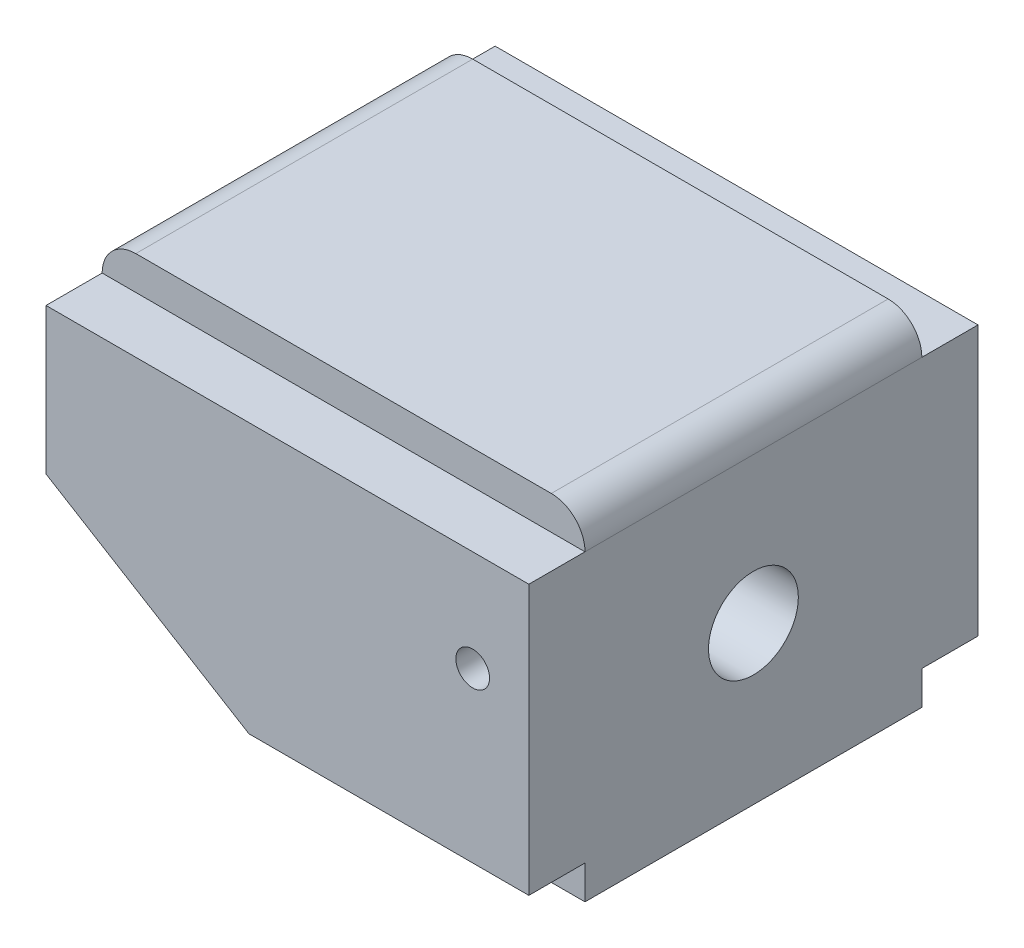
ISO-10303-21;
HEADER;
FILE_DESCRIPTION(('STEP AP214'),'2;1');
FILE_NAME('part.step','',(''),(''),'','','');
FILE_SCHEMA(('AUTOMOTIVE_DESIGN { 1 0 10303 214 1 1 1 1 }'));
ENDSEC;
DATA;
#1=APPLICATION_CONTEXT('core data for automotive mechanical design processes');
#2=APPLICATION_PROTOCOL_DEFINITION('international standard','automotive_design',2000,#1);
#3=PRODUCT_CONTEXT('',#1,'mechanical');
#4=PRODUCT('Part','Part','',(#3));
#5=PRODUCT_RELATED_PRODUCT_CATEGORY('part','',(#4));
#6=PRODUCT_DEFINITION_FORMATION('','',#4);
#7=PRODUCT_DEFINITION_CONTEXT('part definition',#1,'design');
#8=PRODUCT_DEFINITION('design','',#6,#7);
#9=PRODUCT_DEFINITION_SHAPE('','',#8);
#10=(LENGTH_UNIT() NAMED_UNIT(*) SI_UNIT(.MILLI.,.METRE.));
#11=(NAMED_UNIT(*) PLANE_ANGLE_UNIT() SI_UNIT($,.RADIAN.));
#12=(NAMED_UNIT(*) SI_UNIT($,.STERADIAN.) SOLID_ANGLE_UNIT());
#13=UNCERTAINTY_MEASURE_WITH_UNIT(LENGTH_MEASURE(1.E-05),#10,'distance_accuracy_value','');
#14=(GEOMETRIC_REPRESENTATION_CONTEXT(3) GLOBAL_UNCERTAINTY_ASSIGNED_CONTEXT((#13)) GLOBAL_UNIT_ASSIGNED_CONTEXT((#10,
#11,#12)) REPRESENTATION_CONTEXT('',''));
#15=CARTESIAN_POINT('',(0.,0.,0.));
#16=DIRECTION('',(0.,0.,1.));
#17=DIRECTION('',(1.,0.,0.));
#18=AXIS2_PLACEMENT_3D('',#15,#16,#17);
#19=CARTESIAN_POINT('',(0.,0.,-20.));
#20=DIRECTION('',(0.,0.,-1.));
#21=DIRECTION('',(-1.,0.,0.));
#22=AXIS2_PLACEMENT_3D('',#19,#20,#21);
#23=PLANE('',#22);
#24=DIRECTION('',(0.,-1.,0.));
#25=VECTOR('',#24,1.);
#26=CARTESIAN_POINT('',(-43.,14.,-20.));
#27=LINE('',#26,#25);
#28=CARTESIAN_POINT('',(-43.,27.,-20.));
#29=VERTEX_POINT('',#28);
#30=CARTESIAN_POINT('',(-43.,14.,-20.));
#31=VERTEX_POINT('',#30);
#32=EDGE_CURVE('E188',#29,#31,#27,.T.);
#33=ORIENTED_EDGE('',*,*,#32,.F.);
#34=DIRECTION('',(-1.,0.,0.));
#35=VECTOR('',#34,1.);
#36=CARTESIAN_POINT('',(-43.,27.,-20.));
#37=LINE('',#36,#35);
#38=CARTESIAN_POINT('',(0.,27.,-20.));
#39=VERTEX_POINT('',#38);
#40=EDGE_CURVE('E203',#39,#29,#37,.T.);
#41=ORIENTED_EDGE('',*,*,#40,.F.);
#42=DIRECTION('',(0.,1.,0.));
#43=VECTOR('',#42,1.);
#44=CARTESIAN_POINT('',(0.,27.,-20.));
#45=LINE('',#44,#43);
#46=CARTESIAN_POINT('',(0.,3.,-20.));
#47=VERTEX_POINT('',#46);
#48=EDGE_CURVE('E199',#47,#39,#45,.T.);
#49=ORIENTED_EDGE('',*,*,#48,.F.);
#50=DIRECTION('',(1.,0.,0.));
#51=VECTOR('',#50,1.);
#52=CARTESIAN_POINT('',(0.,3.,-20.));
#53=LINE('',#52,#51);
#54=CARTESIAN_POINT('',(-24.9285714285714,3.,-20.));
#55=VERTEX_POINT('',#54);
#56=EDGE_CURVE('E195',#55,#47,#53,.T.);
#57=ORIENTED_EDGE('',*,*,#56,.F.);
#58=DIRECTION('',(0.854198555614439,-0.519946946895745,0.));
#59=VECTOR('',#58,1.);
#60=CARTESIAN_POINT('',(-24.9285714285714,3.,-20.));
#61=LINE('',#60,#59);
#62=EDGE_CURVE('E192',#31,#55,#61,.T.);
#63=ORIENTED_EDGE('',*,*,#62,.F.);
#64=EDGE_LOOP('',(#33,#41,#49,#57,#63));
#65=FACE_BOUND('',#64,.T.);
#66=CARTESIAN_POINT('',(-5.,18.,-20.));
#67=DIRECTION('',(0.,0.,1.));
#68=DIRECTION('',(1.,0.,0.));
#69=AXIS2_PLACEMENT_3D('',#66,#67,#68);
#70=CIRCLE('',#69,1.49999999999999);
#71=CARTESIAN_POINT('',(-3.5,18.,-20.));
#72=VERTEX_POINT('',#71);
#73=EDGE_CURVE('E164',#72,#72,#70,.T.);
#74=ORIENTED_EDGE('',*,*,#73,.T.);
#75=EDGE_LOOP('',(#74));
#76=FACE_BOUND('',#75,.T.);
#77=ADVANCED_FACE('F39',(#65,#76),#23,.T.);
#78=CARTESIAN_POINT('',(0.,0.,20.));
#79=DIRECTION('',(0.,0.,-1.));
#80=DIRECTION('',(-1.,0.,0.));
#81=AXIS2_PLACEMENT_3D('',#78,#79,#80);
#82=PLANE('',#81);
#83=DIRECTION('',(0.,-1.,0.));
#84=VECTOR('',#83,1.);
#85=CARTESIAN_POINT('',(-43.,14.,20.));
#86=LINE('',#85,#84);
#87=CARTESIAN_POINT('',(-43.,27.,20.));
#88=VERTEX_POINT('',#87);
#89=CARTESIAN_POINT('',(-43.,14.,20.));
#90=VERTEX_POINT('',#89);
#91=EDGE_CURVE('E168',#88,#90,#86,.T.);
#92=ORIENTED_EDGE('',*,*,#91,.T.);
#93=DIRECTION('',(0.854198555614439,-0.519946946895745,0.));
#94=VECTOR('',#93,1.);
#95=CARTESIAN_POINT('',(-24.9285714285714,3.,20.));
#96=LINE('',#95,#94);
#97=CARTESIAN_POINT('',(-24.9285714285714,3.,20.));
#98=VERTEX_POINT('',#97);
#99=EDGE_CURVE('E172',#90,#98,#96,.T.);
#100=ORIENTED_EDGE('',*,*,#99,.T.);
#101=DIRECTION('',(1.,0.,0.));
#102=VECTOR('',#101,1.);
#103=CARTESIAN_POINT('',(0.,3.,20.));
#104=LINE('',#103,#102);
#105=CARTESIAN_POINT('',(0.,3.,20.));
#106=VERTEX_POINT('',#105);
#107=EDGE_CURVE('E176',#98,#106,#104,.T.);
#108=ORIENTED_EDGE('',*,*,#107,.T.);
#109=DIRECTION('',(0.,1.,0.));
#110=VECTOR('',#109,1.);
#111=CARTESIAN_POINT('',(0.,27.,20.));
#112=LINE('',#111,#110);
#113=CARTESIAN_POINT('',(0.,27.,20.));
#114=VERTEX_POINT('',#113);
#115=EDGE_CURVE('E180',#106,#114,#112,.T.);
#116=ORIENTED_EDGE('',*,*,#115,.T.);
#117=DIRECTION('',(-1.,0.,0.));
#118=VECTOR('',#117,1.);
#119=CARTESIAN_POINT('',(-43.,27.,20.));
#120=LINE('',#119,#118);
#121=EDGE_CURVE('E184',#114,#88,#120,.T.);
#122=ORIENTED_EDGE('',*,*,#121,.T.);
#123=EDGE_LOOP('',(#92,#100,#108,#116,#122));
#124=FACE_BOUND('',#123,.T.);
#125=CARTESIAN_POINT('',(-5.,18.,20.));
#126=DIRECTION('',(0.,0.,1.));
#127=DIRECTION('',(1.,0.,0.));
#128=AXIS2_PLACEMENT_3D('',#125,#126,#127);
#129=CIRCLE('',#128,1.5);
#130=CARTESIAN_POINT('',(-3.5,18.,20.));
#131=VERTEX_POINT('',#130);
#132=EDGE_CURVE('E157',#131,#131,#129,.T.);
#133=ORIENTED_EDGE('',*,*,#132,.F.);
#134=EDGE_LOOP('',(#133));
#135=FACE_BOUND('',#134,.T.);
#136=ADVANCED_FACE('F321',(#124,#135),#82,.F.);
#137=CARTESIAN_POINT('',(0.,0.,15.));
#138=DIRECTION('',(0.,0.,-1.));
#139=DIRECTION('',(-1.,0.,0.));
#140=AXIS2_PLACEMENT_3D('',#137,#138,#139);
#141=PLANE('',#140);
#142=CARTESIAN_POINT('',(-40.,27.,15.));
#143=DIRECTION('',(0.,0.,-1.));
#144=DIRECTION('',(-1.,0.,0.));
#145=AXIS2_PLACEMENT_3D('',#142,#143,#144);
#146=CIRCLE('',#145,3.);
#147=CARTESIAN_POINT('',(-40.,30.,15.));
#148=VERTEX_POINT('',#147);
#149=CARTESIAN_POINT('',(-43.,27.,15.));
#150=VERTEX_POINT('',#149);
#151=EDGE_CURVE('E290',#148,#150,#146,.F.);
#152=ORIENTED_EDGE('',*,*,#151,.T.);
#153=DIRECTION('',(1.,0.,0.));
#154=VECTOR('',#153,1.);
#155=CARTESIAN_POINT('',(0.,27.,15.));
#156=LINE('',#155,#154);
#157=CARTESIAN_POINT('',(0.,27.,15.));
#158=VERTEX_POINT('',#157);
#159=EDGE_CURVE('E226',#150,#158,#156,.T.);
#160=ORIENTED_EDGE('',*,*,#159,.T.);
#161=CARTESIAN_POINT('',(-3.,27.,15.));
#162=DIRECTION('',(0.,0.,-1.));
#163=DIRECTION('',(-1.,0.,0.));
#164=AXIS2_PLACEMENT_3D('',#161,#162,#163);
#165=CIRCLE('',#164,3.);
#166=CARTESIAN_POINT('',(-3.,30.,15.));
#167=VERTEX_POINT('',#166);
#168=EDGE_CURVE('E287',#158,#167,#165,.F.);
#169=ORIENTED_EDGE('',*,*,#168,.T.);
#170=DIRECTION('',(-1.,0.,0.));
#171=VECTOR('',#170,1.);
#172=CARTESIAN_POINT('',(-43.,30.,15.));
#173=LINE('',#172,#171);
#174=EDGE_CURVE('E235',#167,#148,#173,.T.);
#175=ORIENTED_EDGE('',*,*,#174,.T.);
#176=EDGE_LOOP('',(#152,#160,#169,#175));
#177=FACE_BOUND('',#176,.T.);
#178=ADVANCED_FACE('F350',(#177),#141,.F.);
#179=CARTESIAN_POINT('',(0.,0.,-15.));
#180=DIRECTION('',(0.,0.,-1.));
#181=DIRECTION('',(-1.,0.,0.));
#182=AXIS2_PLACEMENT_3D('',#179,#180,#181);
#183=PLANE('',#182);
#184=DIRECTION('',(1.,0.,0.));
#185=VECTOR('',#184,1.);
#186=CARTESIAN_POINT('',(0.,27.,-15.));
#187=LINE('',#186,#185);
#188=CARTESIAN_POINT('',(-43.,27.,-15.));
#189=VERTEX_POINT('',#188);
#190=CARTESIAN_POINT('',(0.,27.,-15.));
#191=VERTEX_POINT('',#190);
#192=EDGE_CURVE('E211',#189,#191,#187,.T.);
#193=ORIENTED_EDGE('',*,*,#192,.F.);
#194=CARTESIAN_POINT('',(-40.,27.,-15.));
#195=DIRECTION('',(0.,0.,-1.));
#196=DIRECTION('',(-1.,0.,0.));
#197=AXIS2_PLACEMENT_3D('',#194,#195,#196);
#198=CIRCLE('',#197,3.);
#199=CARTESIAN_POINT('',(-40.,30.,-15.));
#200=VERTEX_POINT('',#199);
#201=EDGE_CURVE('E277',#189,#200,#198,.T.);
#202=ORIENTED_EDGE('',*,*,#201,.T.);
#203=DIRECTION('',(-1.,0.,0.));
#204=VECTOR('',#203,1.);
#205=CARTESIAN_POINT('',(-43.,30.,-15.));
#206=LINE('',#205,#204);
#207=CARTESIAN_POINT('',(-3.,30.,-15.));
#208=VERTEX_POINT('',#207);
#209=EDGE_CURVE('E250',#208,#200,#206,.T.);
#210=ORIENTED_EDGE('',*,*,#209,.F.);
#211=CARTESIAN_POINT('',(-3.,27.,-15.));
#212=DIRECTION('',(0.,0.,-1.));
#213=DIRECTION('',(-1.,0.,0.));
#214=AXIS2_PLACEMENT_3D('',#211,#212,#213);
#215=CIRCLE('',#214,3.);
#216=EDGE_CURVE('E273',#208,#191,#215,.T.);
#217=ORIENTED_EDGE('',*,*,#216,.T.);
#218=EDGE_LOOP('',(#193,#202,#210,#217));
#219=FACE_BOUND('',#218,.T.);
#220=ADVANCED_FACE('F357',(#219),#183,.T.);
#221=CARTESIAN_POINT('',(0.,30.,15.));
#222=DIRECTION('',(-1.,0.,0.));
#223=DIRECTION('',(0.,0.,1.));
#224=AXIS2_PLACEMENT_3D('',#221,#222,#223);
#225=PLANE('',#224);
#226=CARTESIAN_POINT('',(0.,14.,0.));
#227=DIRECTION('',(1.,0.,0.));
#228=DIRECTION('',(0.,0.,-1.));
#229=AXIS2_PLACEMENT_3D('',#226,#227,#228);
#230=CIRCLE('',#229,3.99999999999999);
#231=CARTESIAN_POINT('',(0.,14.,-3.99999999999999));
#232=VERTEX_POINT('',#231);
#233=EDGE_CURVE('E152',#232,#232,#230,.T.);
#234=ORIENTED_EDGE('',*,*,#233,.F.);
#235=EDGE_LOOP('',(#234));
#236=FACE_BOUND('',#235,.T.);
#237=DIRECTION('',(0.,1.,0.));
#238=VECTOR('',#237,1.);
#239=CARTESIAN_POINT('',(0.,30.,-15.));
#240=LINE('',#239,#238);
#241=CARTESIAN_POINT('',(0.,0.,-15.));
#242=VERTEX_POINT('',#241);
#243=CARTESIAN_POINT('',(0.,3.,-15.));
#244=VERTEX_POINT('',#243);
#245=EDGE_CURVE('E232',#242,#244,#240,.T.);
#246=ORIENTED_EDGE('',*,*,#245,.T.);
#247=DIRECTION('',(0.,0.,1.));
#248=VECTOR('',#247,1.);
#249=CARTESIAN_POINT('',(0.,3.,-20.));
#250=LINE('',#249,#248);
#251=EDGE_CURVE('E218',#47,#244,#250,.T.);
#252=ORIENTED_EDGE('',*,*,#251,.F.);
#253=ORIENTED_EDGE('',*,*,#48,.T.);
#254=DIRECTION('',(0.,0.,1.));
#255=VECTOR('',#254,1.);
#256=CARTESIAN_POINT('',(0.,27.,-20.));
#257=LINE('',#256,#255);
#258=EDGE_CURVE('E213',#39,#191,#257,.T.);
#259=ORIENTED_EDGE('',*,*,#258,.T.);
#260=DIRECTION('',(0.,0.,-1.));
#261=VECTOR('',#260,1.);
#262=CARTESIAN_POINT('',(0.,27.,15.));
#263=LINE('',#262,#261);
#264=EDGE_CURVE('E54',#191,#158,#263,.F.);
#265=ORIENTED_EDGE('',*,*,#264,.T.);
#266=EDGE_CURVE('E217',#158,#114,#257,.T.);
#267=ORIENTED_EDGE('',*,*,#266,.T.);
#268=ORIENTED_EDGE('',*,*,#115,.F.);
#269=CARTESIAN_POINT('',(0.,3.,15.));
#270=VERTEX_POINT('',#269);
#271=EDGE_CURVE('E221',#270,#106,#250,.T.);
#272=ORIENTED_EDGE('',*,*,#271,.F.);
#273=DIRECTION('',(0.,1.,0.));
#274=VECTOR('',#273,1.);
#275=CARTESIAN_POINT('',(0.,30.,15.));
#276=LINE('',#275,#274);
#277=CARTESIAN_POINT('',(0.,0.,15.));
#278=VERTEX_POINT('',#277);
#279=EDGE_CURVE('E61',#278,#270,#276,.T.);
#280=ORIENTED_EDGE('',*,*,#279,.F.);
#281=DIRECTION('',(0.,0.,-1.));
#282=VECTOR('',#281,1.);
#283=CARTESIAN_POINT('',(0.,0.,15.));
#284=LINE('',#283,#282);
#285=EDGE_CURVE('E246',#278,#242,#284,.T.);
#286=ORIENTED_EDGE('',*,*,#285,.T.);
#287=EDGE_LOOP('',(#246,#252,#253,#259,#265,#267,#268,#272,#280,#286));
#288=FACE_BOUND('',#287,.T.);
#289=ADVANCED_FACE('F298',(#236,#288),#225,.F.);
#290=CARTESIAN_POINT('',(-43.,30.,15.));
#291=DIRECTION('',(0.,-1.,0.));
#292=DIRECTION('',(0.,0.,-1.));
#293=AXIS2_PLACEMENT_3D('',#290,#291,#292);
#294=PLANE('',#293);
#295=ORIENTED_EDGE('',*,*,#209,.T.);
#296=DIRECTION('',(0.,0.,-1.));
#297=VECTOR('',#296,1.);
#298=CARTESIAN_POINT('',(-40.,30.,15.));
#299=LINE('',#298,#297);
#300=EDGE_CURVE('E284',#200,#148,#299,.F.);
#301=ORIENTED_EDGE('',*,*,#300,.T.);
#302=ORIENTED_EDGE('',*,*,#174,.F.);
#303=DIRECTION('',(0.,0.,-1.));
#304=VECTOR('',#303,1.);
#305=CARTESIAN_POINT('',(-3.,30.,15.));
#306=LINE('',#305,#304);
#307=EDGE_CURVE('E280',#167,#208,#306,.T.);
#308=ORIENTED_EDGE('',*,*,#307,.T.);
#309=EDGE_LOOP('',(#295,#301,#302,#308));
#310=FACE_BOUND('',#309,.T.);
#311=ADVANCED_FACE('F401',(#310),#294,.F.);
#312=CARTESIAN_POINT('',(-43.,14.,15.));
#313=DIRECTION('',(1.,0.,0.));
#314=DIRECTION('',(0.,0.,-1.));
#315=AXIS2_PLACEMENT_3D('',#312,#313,#314);
#316=PLANE('',#315);
#317=DIRECTION('',(0.,0.,-1.));
#318=VECTOR('',#317,1.);
#319=CARTESIAN_POINT('',(-43.,14.,15.));
#320=LINE('',#319,#318);
#321=EDGE_CURVE('E266',#90,#31,#320,.T.);
#322=ORIENTED_EDGE('',*,*,#321,.F.);
#323=ORIENTED_EDGE('',*,*,#91,.F.);
#324=DIRECTION('',(0.,0.,1.));
#325=VECTOR('',#324,1.);
#326=CARTESIAN_POINT('',(-43.,27.,-20.));
#327=LINE('',#326,#325);
#328=EDGE_CURVE('E212',#150,#88,#327,.T.);
#329=ORIENTED_EDGE('',*,*,#328,.F.);
#330=DIRECTION('',(0.,0.,-1.));
#331=VECTOR('',#330,1.);
#332=CARTESIAN_POINT('',(-43.,27.,15.));
#333=LINE('',#332,#331);
#334=EDGE_CURVE('E269',#150,#189,#333,.T.);
#335=ORIENTED_EDGE('',*,*,#334,.T.);
#336=EDGE_CURVE('E208',#29,#189,#327,.T.);
#337=ORIENTED_EDGE('',*,*,#336,.F.);
#338=ORIENTED_EDGE('',*,*,#32,.T.);
#339=EDGE_LOOP('',(#322,#323,#329,#335,#337,#338));
#340=FACE_BOUND('',#339,.T.);
#341=ADVANCED_FACE('F327',(#340),#316,.F.);
#342=CARTESIAN_POINT('',(-20.,0.,15.));
#343=DIRECTION('',(0.519946946895745,0.854198555614439,0.));
#344=DIRECTION('',(-0.854198555614439,0.519946946895745,0.));
#345=AXIS2_PLACEMENT_3D('',#342,#343,#344);
#346=PLANE('',#345);
#347=DIRECTION('',(0.854198555614439,-0.519946946895745,0.));
#348=VECTOR('',#347,1.);
#349=CARTESIAN_POINT('',(-20.,0.,15.));
#350=LINE('',#349,#348);
#351=CARTESIAN_POINT('',(-24.9285714285714,3.,15.));
#352=VERTEX_POINT('',#351);
#353=CARTESIAN_POINT('',(-20.,0.,15.));
#354=VERTEX_POINT('',#353);
#355=EDGE_CURVE('E240',#352,#354,#350,.T.);
#356=ORIENTED_EDGE('',*,*,#355,.F.);
#357=DIRECTION('',(0.,0.,1.));
#358=VECTOR('',#357,1.);
#359=CARTESIAN_POINT('',(-24.9285714285714,3.,-20.));
#360=LINE('',#359,#358);
#361=EDGE_CURVE('E207',#352,#98,#360,.T.);
#362=ORIENTED_EDGE('',*,*,#361,.T.);
#363=ORIENTED_EDGE('',*,*,#99,.F.);
#364=ORIENTED_EDGE('',*,*,#321,.T.);
#365=ORIENTED_EDGE('',*,*,#62,.T.);
#366=CARTESIAN_POINT('',(-24.9285714285714,2.99999999999999,-15.));
#367=VERTEX_POINT('',#366);
#368=EDGE_CURVE('E69',#55,#367,#360,.T.);
#369=ORIENTED_EDGE('',*,*,#368,.T.);
#370=DIRECTION('',(0.854198555614439,-0.519946946895745,0.));
#371=VECTOR('',#370,1.);
#372=CARTESIAN_POINT('',(-20.,0.,-15.));
#373=LINE('',#372,#371);
#374=CARTESIAN_POINT('',(-20.,0.,-15.));
#375=VERTEX_POINT('',#374);
#376=EDGE_CURVE('E254',#367,#375,#373,.T.);
#377=ORIENTED_EDGE('',*,*,#376,.T.);
#378=DIRECTION('',(0.,0.,-1.));
#379=VECTOR('',#378,1.);
#380=CARTESIAN_POINT('',(-20.,0.,15.));
#381=LINE('',#380,#379);
#382=EDGE_CURVE('E262',#354,#375,#381,.T.);
#383=ORIENTED_EDGE('',*,*,#382,.F.);
#384=EDGE_LOOP('',(#356,#362,#363,#364,#365,#369,#377,#383));
#385=FACE_BOUND('',#384,.T.);
#386=ADVANCED_FACE('F316',(#385),#346,.F.);
#387=CARTESIAN_POINT('',(0.,0.,15.));
#388=DIRECTION('',(0.,1.,0.));
#389=DIRECTION('',(0.,0.,1.));
#390=AXIS2_PLACEMENT_3D('',#387,#388,#389);
#391=PLANE('',#390);
#392=DIRECTION('',(1.,0.,0.));
#393=VECTOR('',#392,1.);
#394=CARTESIAN_POINT('',(0.,0.,-15.));
#395=LINE('',#394,#393);
#396=EDGE_CURVE('E236',#375,#242,#395,.T.);
#397=ORIENTED_EDGE('',*,*,#396,.T.);
#398=ORIENTED_EDGE('',*,*,#285,.F.);
#399=DIRECTION('',(1.,0.,0.));
#400=VECTOR('',#399,1.);
#401=CARTESIAN_POINT('',(0.,0.,15.));
#402=LINE('',#401,#400);
#403=EDGE_CURVE('E243',#354,#278,#402,.T.);
#404=ORIENTED_EDGE('',*,*,#403,.F.);
#405=ORIENTED_EDGE('',*,*,#382,.T.);
#406=EDGE_LOOP('',(#397,#398,#404,#405));
#407=FACE_BOUND('',#406,.T.);
#408=ADVANCED_FACE('F345',(#407),#391,.F.);
#409=ORIENTED_EDGE('',*,*,#279,.T.);
#410=DIRECTION('',(-1.,0.,0.));
#411=VECTOR('',#410,1.);
#412=CARTESIAN_POINT('',(0.,3.,15.));
#413=LINE('',#412,#411);
#414=EDGE_CURVE('E229',#270,#352,#413,.T.);
#415=ORIENTED_EDGE('',*,*,#414,.T.);
#416=ORIENTED_EDGE('',*,*,#355,.T.);
#417=ORIENTED_EDGE('',*,*,#403,.T.);
#418=EDGE_LOOP('',(#409,#415,#416,#417));
#419=FACE_BOUND('',#418,.T.);
#420=ADVANCED_FACE('F347',(#419),#141,.F.);
#421=DIRECTION('',(-1.,0.,0.));
#422=VECTOR('',#421,1.);
#423=CARTESIAN_POINT('',(0.,3.,-15.));
#424=LINE('',#423,#422);
#425=EDGE_CURVE('E11',#244,#367,#424,.T.);
#426=ORIENTED_EDGE('',*,*,#425,.F.);
#427=ORIENTED_EDGE('',*,*,#245,.F.);
#428=ORIENTED_EDGE('',*,*,#396,.F.);
#429=ORIENTED_EDGE('',*,*,#376,.F.);
#430=EDGE_LOOP('',(#426,#427,#428,#429));
#431=FACE_BOUND('',#430,.T.);
#432=ADVANCED_FACE('F342',(#431),#183,.T.);
#433=CARTESIAN_POINT('',(-40.,27.,15.));
#434=DIRECTION('',(0.,0.,-1.));
#435=DIRECTION('',(-1.,0.,0.));
#436=AXIS2_PLACEMENT_3D('',#433,#434,#435);
#437=CYLINDRICAL_SURFACE('',#436,3.);
#438=ORIENTED_EDGE('',*,*,#151,.F.);
#439=ORIENTED_EDGE('',*,*,#300,.F.);
#440=ORIENTED_EDGE('',*,*,#201,.F.);
#441=ORIENTED_EDGE('',*,*,#334,.F.);
#442=EDGE_LOOP('',(#438,#439,#440,#441));
#443=FACE_BOUND('',#442,.T.);
#444=ADVANCED_FACE('F355',(#443),#437,.T.);
#445=CARTESIAN_POINT('',(-3.,27.,15.));
#446=DIRECTION('',(0.,0.,-1.));
#447=DIRECTION('',(-1.,0.,0.));
#448=AXIS2_PLACEMENT_3D('',#445,#446,#447);
#449=CYLINDRICAL_SURFACE('',#448,3.);
#450=ORIENTED_EDGE('',*,*,#168,.F.);
#451=ORIENTED_EDGE('',*,*,#264,.F.);
#452=ORIENTED_EDGE('',*,*,#216,.F.);
#453=ORIENTED_EDGE('',*,*,#307,.F.);
#454=EDGE_LOOP('',(#450,#451,#452,#453));
#455=FACE_BOUND('',#454,.T.);
#456=ADVANCED_FACE('F41',(#455),#449,.T.);
#457=CARTESIAN_POINT('',(0.,3.,-20.));
#458=DIRECTION('',(0.,-1.,0.));
#459=DIRECTION('',(1.,0.,0.));
#460=AXIS2_PLACEMENT_3D('',#457,#458,#459);
#461=PLANE('',#460);
#462=ORIENTED_EDGE('',*,*,#251,.T.);
#463=ORIENTED_EDGE('',*,*,#425,.T.);
#464=ORIENTED_EDGE('',*,*,#368,.F.);
#465=ORIENTED_EDGE('',*,*,#56,.T.);
#466=EDGE_LOOP('',(#462,#463,#464,#465));
#467=FACE_BOUND('',#466,.T.);
#468=ADVANCED_FACE('F336',(#467),#461,.T.);
#469=CARTESIAN_POINT('',(-43.,27.,-20.));
#470=DIRECTION('',(0.,1.,0.));
#471=DIRECTION('',(-1.,0.,0.));
#472=AXIS2_PLACEMENT_3D('',#469,#470,#471);
#473=PLANE('',#472);
#474=ORIENTED_EDGE('',*,*,#336,.T.);
#475=ORIENTED_EDGE('',*,*,#192,.T.);
#476=ORIENTED_EDGE('',*,*,#258,.F.);
#477=ORIENTED_EDGE('',*,*,#40,.T.);
#478=EDGE_LOOP('',(#474,#475,#476,#477));
#479=FACE_BOUND('',#478,.T.);
#480=ADVANCED_FACE('F368',(#479),#473,.T.);
#481=ORIENTED_EDGE('',*,*,#414,.F.);
#482=ORIENTED_EDGE('',*,*,#271,.T.);
#483=ORIENTED_EDGE('',*,*,#107,.F.);
#484=ORIENTED_EDGE('',*,*,#361,.F.);
#485=EDGE_LOOP('',(#481,#482,#483,#484));
#486=FACE_BOUND('',#485,.T.);
#487=ADVANCED_FACE('F324',(#486),#461,.T.);
#488=ORIENTED_EDGE('',*,*,#159,.F.);
#489=ORIENTED_EDGE('',*,*,#328,.T.);
#490=ORIENTED_EDGE('',*,*,#121,.F.);
#491=ORIENTED_EDGE('',*,*,#266,.F.);
#492=EDGE_LOOP('',(#488,#489,#490,#491));
#493=FACE_BOUND('',#492,.T.);
#494=ADVANCED_FACE('F308',(#493),#473,.T.);
#495=CARTESIAN_POINT('',(-5.,18.,20.));
#496=DIRECTION('',(0.,0.,1.));
#497=DIRECTION('',(1.,0.,0.));
#498=AXIS2_PLACEMENT_3D('',#495,#496,#497);
#499=CYLINDRICAL_SURFACE('',#498,1.5);
#500=CARTESIAN_POINT('',(-3.5,18.,0.));
#501=CARTESIAN_POINT('',(-3.50000620245048,18.0000011521972,0.112253813194499));
#502=CARTESIAN_POINT('',(-3.49997935411279,17.9952731668514,0.224489022286069));
#503=CARTESIAN_POINT('',(-3.50015444303706,17.9763936633966,0.448212951522597));
#504=CARTESIAN_POINT('',(-3.50035645726274,17.9622389758607,0.559701407857565));
#505=CARTESIAN_POINT('',(-3.50177909634379,17.9245852436999,0.781195213477195));
#506=CARTESIAN_POINT('',(-3.50300074715765,17.901076799796,0.891198955509812));
#507=CARTESIAN_POINT('',(-3.50777337040807,17.8448983533318,1.10876827801494));
#508=CARTESIAN_POINT('',(-3.51132342282349,17.8122319722641,1.21633480414415));
#509=CARTESIAN_POINT('',(-3.5208956866383,17.7491263680478,1.39651385036045));
#510=CARTESIAN_POINT('',(-3.52586355476003,17.7209333104896,1.46997517257604));
#511=CARTESIAN_POINT('',(-3.53862808864286,17.660365882966,1.61489471420972));
#512=CARTESIAN_POINT('',(-3.54642405686461,17.6279925453167,1.68635342288649));
#513=CARTESIAN_POINT('',(-3.56573212884011,17.5593832430154,1.8267120926274));
#514=CARTESIAN_POINT('',(-3.57723670652693,17.5231551998197,1.89561692330754));
#515=CARTESIAN_POINT('',(-3.60498993828821,17.4472073292669,2.0304556958559));
#516=CARTESIAN_POINT('',(-3.6212365603243,17.4074890026343,2.0963908963153));
#517=CARTESIAN_POINT('',(-3.66624782158203,17.310906725328,2.24686080092305));
#518=CARTESIAN_POINT('',(-3.69739768652298,17.2528570859315,2.32995895154095));
#519=CARTESIAN_POINT('',(-3.77324435961528,17.1339633215117,2.48756377183552));
#520=CARTESIAN_POINT('',(-3.81792156225945,17.0731233481555,2.5620826613375));
#521=CARTESIAN_POINT('',(-3.9120550157852,16.9654267942191,2.68541918880164));
#522=CARTESIAN_POINT('',(-3.95848077943344,16.9183447914689,2.73633398018194));
#523=CARTESIAN_POINT('',(-4.06182656128878,16.8275884420056,2.83001592638114));
#524=CARTESIAN_POINT('',(-4.11874307763934,16.7839129650833,2.87278579035268));
#525=CARTESIAN_POINT('',(-4.24323418183672,16.702746273259,2.94929037477127));
#526=CARTESIAN_POINT('',(-4.31089623201352,16.6653114821772,2.98294421714603));
#527=CARTESIAN_POINT('',(-4.4548659648684,16.6003408677028,3.03975495341121));
#528=CARTESIAN_POINT('',(-4.5311672971729,16.5727978346302,3.06291949572995));
#529=CARTESIAN_POINT('',(-4.67815826221678,16.5332483406901,3.09567677546198));
#530=CARTESIAN_POINT('',(-4.74807715932901,16.5195773117587,3.10674209184214));
#531=CARTESIAN_POINT('',(-4.88994394649021,16.5023408745069,3.12064401621645));
#532=CARTESIAN_POINT('',(-4.96189083482728,16.498770562383,3.12348461724864));
#533=CARTESIAN_POINT('',(-5.1000338260564,16.5018640412417,3.12100531494663));
#534=CARTESIAN_POINT('',(-5.16625936393943,16.5077858422173,3.11627709710111));
#535=CARTESIAN_POINT('',(-5.29648059413372,16.5281170385873,3.09980544669156));
#536=CARTESIAN_POINT('',(-5.36047670929407,16.5425248150823,3.08806335218339));
#537=CARTESIAN_POINT('',(-5.48461180295057,16.5789642126978,3.05769535809704));
#538=CARTESIAN_POINT('',(-5.54474603627327,16.6010050079544,3.03906117306432));
#539=CARTESIAN_POINT('',(-5.65970732706845,16.6513974783353,2.99519670487142));
#540=CARTESIAN_POINT('',(-5.71453358712251,16.6797500995827,2.96996543272935));
#541=CARTESIAN_POINT('',(-5.82127208444356,16.7431748454916,2.9115217101668));
#542=CARTESIAN_POINT('',(-5.87277282715893,16.7785610193545,2.87790160660854));
#543=CARTESIAN_POINT('',(-5.9682373935377,16.8527512899344,2.80437977383443));
#544=CARTESIAN_POINT('',(-6.01219748071489,16.891557066773,2.76447494913992));
#545=CARTESIAN_POINT('',(-6.11066641127534,16.9885169750333,2.66004141680728));
#546=CARTESIAN_POINT('',(-6.16109389234535,17.0475591177279,2.5924841916095));
#547=CARTESIAN_POINT('',(-6.24802834797005,17.1646684816818,2.44817334492198));
#548=CARTESIAN_POINT('',(-6.28450590026651,17.2227333981019,2.37140072985991));
#549=CARTESIAN_POINT('',(-6.33778219577563,17.3199053481034,2.2323526722512));
#550=CARTESIAN_POINT('',(-6.35723480762451,17.3599298642362,2.17169025720684));
#551=CARTESIAN_POINT('',(-6.39105043832198,17.4371868454056,2.04722007990197));
#552=CARTESIAN_POINT('',(-6.40541105323099,17.474417985163,1.98341084817368));
#553=CARTESIAN_POINT('',(-6.43002521854089,17.5456324479305,1.85310996467654));
#554=CARTESIAN_POINT('',(-6.44027146573449,17.5796099148377,1.78661377160134));
#555=CARTESIAN_POINT('',(-6.45750614941373,17.6439334585929,1.65147016196662));
#556=CARTESIAN_POINT('',(-6.46449365413004,17.674278494982,1.58282213611603));
#557=CARTESIAN_POINT('',(-6.47843912112647,17.7432241880872,1.41412192527371));
#558=CARTESIAN_POINT('',(-6.48411702295658,17.7798365757532,1.31314687149078));
#559=CARTESIAN_POINT('',(-6.4923139108181,17.8448516921194,1.1084494668458));
#560=CARTESIAN_POINT('',(-6.49483169025552,17.8732512818361,1.00472608204473));
#561=CARTESIAN_POINT('',(-6.49814658019946,17.9216119985208,0.795303484757186));
#562=CARTESIAN_POINT('',(-6.49894364477631,17.9415729002301,0.689604219606057));
#563=CARTESIAN_POINT('',(-6.49983742051351,17.9729161502832,0.476956138551682));
#564=CARTESIAN_POINT('',(-6.49993422772092,17.9842996749053,0.370007496028218));
#565=CARTESIAN_POINT('',(-6.50001656027553,17.9985161184493,0.154067091866818));
#566=CARTESIAN_POINT('',(-6.50000053946294,18.001229490802,0.0450674394840363));
#567=CARTESIAN_POINT('',(-6.49999928724502,17.9977507297342,-0.172799313157123));
#568=CARTESIAN_POINT('',(-6.50001405858433,17.9915578024691,-0.281666400733936));
#569=CARTESIAN_POINT('',(-6.499743498288,17.9703029738754,-0.498572652693374));
#570=CARTESIAN_POINT('',(-6.49945805034429,17.9552376362782,-0.606611479860204));
#571=CARTESIAN_POINT('',(-6.49779187144155,17.9163376517951,-0.821079833239417));
#572=CARTESIAN_POINT('',(-6.4964113315052,17.8925045347081,-0.927509636823037));
#573=CARTESIAN_POINT('',(-6.49174893971451,17.8411793716483,-1.1195606694533));
#574=CARTESIAN_POINT('',(-6.48884269547836,17.8150605430892,-1.20555984992965));
#575=CARTESIAN_POINT('',(-6.48049816137566,17.7571370772413,-1.37549094378235));
#576=CARTESIAN_POINT('',(-6.4750603395616,17.7253334916519,-1.45942323627776));
#577=CARTESIAN_POINT('',(-6.46052640894038,17.6563377572816,-1.62455627295329));
#578=CARTESIAN_POINT('',(-6.45143697253818,17.6191555155103,-1.70576170810029));
#579=CARTESIAN_POINT('',(-6.42825175890459,17.5397780101375,-1.86490640529917));
#580=CARTESIAN_POINT('',(-6.41415870313883,17.4975854799152,-1.94284741715672));
#581=CARTESIAN_POINT('',(-6.37511449644616,17.3978343455916,-2.11346192431006));
#582=CARTESIAN_POINT('',(-6.3483428363494,17.3390521548611,-2.20502919893777));
#583=CARTESIAN_POINT('',(-6.28121589923108,17.2168491974618,-2.37974534290643));
#584=CARTESIAN_POINT('',(-6.24087971717683,17.1534350489558,-2.46290583373956));
#585=CARTESIAN_POINT('',(-6.15383886501585,17.0394619419769,-2.60152628579264));
#586=CARTESIAN_POINT('',(-6.1103428803186,16.9890552368756,-2.6591062120822));
#587=CARTESIAN_POINT('',(-6.01189001946891,16.8905373584563,-2.76587221689439));
#588=CARTESIAN_POINT('',(-5.95694674554257,16.8424235432448,-2.81506813270193));
#589=CARTESIAN_POINT('',(-5.84542117127969,16.7593225962325,-2.89637112942533));
#590=CARTESIAN_POINT('',(-5.79056359762045,16.7234738606843,-2.92995648399497));
#591=CARTESIAN_POINT('',(-5.67343656479597,16.6579953433093,-2.98948514665152));
#592=CARTESIAN_POINT('',(-5.61116884924909,16.6283641030123,-3.01543024752983));
#593=CARTESIAN_POINT('',(-5.48033580730297,16.5772455042714,-3.05924083284381));
#594=CARTESIAN_POINT('',(-5.41174342672317,16.5557953579318,-3.07706946860383));
#595=CARTESIAN_POINT('',(-5.27057859921066,16.5228288265687,-3.10415827260668));
#596=CARTESIAN_POINT('',(-5.19800703945946,16.5113102367475,-3.1134203426536));
#597=CARTESIAN_POINT('',(-5.05752896168246,16.4995865472223,-3.12283770841636));
#598=CARTESIAN_POINT('',(-4.98973937550527,16.4985164826938,-3.12368932449892));
#599=CARTESIAN_POINT('',(-4.85495178029958,16.5055063537236,-3.11808570047743));
#600=CARTESIAN_POINT('',(-4.78795355930144,16.5135637857229,-3.11163246400416));
#601=CARTESIAN_POINT('',(-4.65820914720297,16.5380016369181,-3.09172849273061));
#602=CARTESIAN_POINT('',(-4.59540074614997,16.5541874323075,-3.07844121865271));
#603=CARTESIAN_POINT('',(-4.47401034187806,16.5937949875963,-3.04514245608758));
#604=CARTESIAN_POINT('',(-4.4154284379767,16.6172169174679,-3.0251308096482));
#605=CARTESIAN_POINT('',(-4.30156894919104,16.6709737014107,-2.97778859176237));
#606=CARTESIAN_POINT('',(-4.24650797678013,16.7015416550673,-2.95020401569674));
#607=CARTESIAN_POINT('',(-4.14316423960242,16.7672838279305,-2.8886270183727));
#608=CARTESIAN_POINT('',(-4.09488377821536,16.8024596046367,-2.85463242873754));
#609=CARTESIAN_POINT('',(-4.00043950399984,16.8797292635556,-2.77677606033032));
#610=CARTESIAN_POINT('',(-3.95511223027731,16.9221571790424,-2.73223666633828));
#611=CARTESIAN_POINT('',(-3.87298372642466,17.0083421962598,-2.63704421315187));
#612=CARTESIAN_POINT('',(-3.83618672806351,17.0520999455825,-2.58638813841451));
#613=CARTESIAN_POINT('',(-3.77673887238577,17.130763264222,-2.49026191035117));
#614=CARTESIAN_POINT('',(-3.75272846717743,17.1657465899877,-2.44567915957187));
#615=CARTESIAN_POINT('',(-3.70923661074053,17.2347601359693,-2.3536451324935));
#616=CARTESIAN_POINT('',(-3.68975742646395,17.2687898716522,-2.30619243526536));
#617=CARTESIAN_POINT('',(-3.63719499946378,17.3687632325278,-2.15993884639669));
#618=CARTESIAN_POINT('',(-3.61008331951178,17.4324534391905,-2.05740833171636));
#619=CARTESIAN_POINT('',(-3.5726173420954,17.5364955033752,-1.87127967684725));
#620=CARTESIAN_POINT('',(-3.55978744169551,17.57874802415,-1.7891744534849));
#621=CARTESIAN_POINT('',(-3.53900961715094,17.6576935324388,-1.6216778716291));
#622=CARTESIAN_POINT('',(-3.5310643787188,17.6943834531557,-1.53628473272312));
#623=CARTESIAN_POINT('',(-3.51863751921115,17.7617956927773,-1.36292077312088));
#624=CARTESIAN_POINT('',(-3.5141569693214,17.7925161638974,-1.27494916395108));
#625=CARTESIAN_POINT('',(-3.50748899923528,17.8477516217596,-1.097034849916));
#626=CARTESIAN_POINT('',(-3.50530102624699,17.8722681033414,-1.00709262555276));
#627=CARTESIAN_POINT('',(-3.50125797346475,17.9289116406555,-0.766402973166942));
#628=CARTESIAN_POINT('',(-3.50055385442784,17.9555496848692,-0.614312758464328));
#629=CARTESIAN_POINT('',(-3.49992073094662,17.991090347186,-0.308136264365992));
#630=CARTESIAN_POINT('',(-3.49999148811721,17.9999984187915,-0.154050613421639));
#631=CARTESIAN_POINT('',(-3.5,18.,0.));
#632=B_SPLINE_CURVE_WITH_KNOTS('',3,(#500,#501,#502,#503,#504,#505,#506,#507,#508,#509,#510,
#511,#512,#513,#514,#515,#516,#517,#518,#519,#520,#521,#522,#523,#524,#525,#526,#527,#528,#529,
#530,#531,#532,#533,#534,#535,#536,#537,#538,#539,#540,#541,#542,#543,#544,#545,#546,#547,#548,
#549,#550,#551,#552,#553,#554,#555,#556,#557,#558,#559,#560,#561,#562,#563,#564,#565,#566,#567,
#568,#569,#570,#571,#572,#573,#574,#575,#576,#577,#578,#579,#580,#581,#582,#583,#584,#585,#586,
#587,#588,#589,#590,#591,#592,#593,#594,#595,#596,#597,#598,#599,#600,#601,#602,#603,#604,#605,
#606,#607,#608,#609,#610,#611,#612,#613,#614,#615,#616,#617,#618,#619,#620,#621,#622,#623,#624,
#625,#626,#627,#628,#629,#630,#631),.UNSPECIFIED.,.T.,.F.,(4,2,2,2,2,2,2,2,2,2,2,2,2,2,2,2,2,2,
2,2,2,2,2,2,2,2,2,2,2,2,2,2,2,2,2,2,2,2,2,2,2,2,2,2,2,2,2,2,2,2,2,2,2,2,2,2,2,2,2,2,2,2,2,2,2,
4),(0.,0.336630337233886,0.673373912824161,1.01045672890326,1.34740643365199,1.58377032855399,
1.82007596485947,2.05590504172369,2.29163321022277,2.60873529650748,2.92537998105976,
3.17477119001717,3.42407930142998,3.67553178355679,3.92680061896799,4.14193844968391,
4.35697181505751,4.55599925822925,4.7549887445281,4.95421823141331,5.15347760231094,
5.36549817246194,5.57762349977985,5.88466495444469,6.19235047505094,6.41775952558654,
6.64327485083809,6.86918872601424,7.095167156999,7.41739014878481,7.73973613396239,
8.0620907231584,8.38440109746932,8.71113682273598,9.03790167271758,9.3647931614442,
9.69162764129564,9.96118399686833,10.2306905351067,10.4997068417968,10.7685770542615,
11.1037454050135,11.4384438960205,11.7015368364631,11.9643189220179,12.1842974098121,
12.4042242382787,12.6251398118765,12.8460063297535,13.0484164054024,13.2507709759183,
13.4484962363665,13.6462261416067,13.8516333399682,14.0571101484557,14.2855023739519,
14.5140076608233,14.698389212343,14.8828628117802,15.2525096307645,15.5318657359417,
15.8113753012298,16.0909712486215,16.370499763609,16.8326138487139,17.2945857717288),.UNSPECIFIED.);
#633=CARTESIAN_POINT('',(-3.5,18.,0.));
#634=VERTEX_POINT('',#633);
#635=EDGE_CURVE('E43',#634,#634,#632,.T.);
#636=ORIENTED_EDGE('',*,*,#635,.T.);
#637=EDGE_LOOP('',(#636));
#638=FACE_BOUND('',#637,.T.);
#639=ORIENTED_EDGE('',*,*,#73,.F.);
#640=EDGE_LOOP('',(#639));
#641=FACE_BOUND('',#640,.T.);
#642=ORIENTED_EDGE('',*,*,#132,.T.);
#643=EDGE_LOOP('',(#642));
#644=FACE_BOUND('',#643,.T.);
#645=ADVANCED_FACE('F379',(#638,#641,#644),#499,.F.);
#646=CARTESIAN_POINT('',(0.,14.,0.));
#647=DIRECTION('',(1.,0.,0.));
#648=DIRECTION('',(0.,0.,-1.));
#649=AXIS2_PLACEMENT_3D('',#646,#647,#648);
#650=CYLINDRICAL_SURFACE('',#649,3.99999999999999);
#651=ORIENTED_EDGE('',*,*,#233,.T.);
#652=EDGE_LOOP('',(#651));
#653=FACE_BOUND('',#652,.T.);
#654=CARTESIAN_POINT('',(-13.,14.,0.));
#655=DIRECTION('',(1.,0.,0.));
#656=DIRECTION('',(0.,0.,-1.));
#657=AXIS2_PLACEMENT_3D('',#654,#655,#656);
#658=CIRCLE('',#657,4.);
#659=CARTESIAN_POINT('',(-13.,14.,-4.));
#660=VERTEX_POINT('',#659);
#661=EDGE_CURVE('E149',#660,#660,#658,.T.);
#662=ORIENTED_EDGE('',*,*,#661,.F.);
#663=EDGE_LOOP('',(#662));
#664=FACE_BOUND('',#663,.T.);
#665=ORIENTED_EDGE('',*,*,#635,.F.);
#666=EDGE_LOOP('',(#665));
#667=FACE_BOUND('',#666,.T.);
#668=ADVANCED_FACE('F145',(#653,#664,#667),#650,.F.);
#669=CARTESIAN_POINT('',(-13.,14.,0.));
#670=DIRECTION('',(1.,0.,0.));
#671=DIRECTION('',(0.,0.,-1.));
#672=AXIS2_PLACEMENT_3D('',#669,#670,#671);
#673=CONICAL_SURFACE('',#672,4.,1.02974425867665);
#674=CARTESIAN_POINT('',(-15.4034424761102,14.,0.));
#675=VERTEX_POINT('',#674);
#676=VERTEX_LOOP('',#675);
#677=FACE_BOUND('',#676,.T.);
#678=ORIENTED_EDGE('',*,*,#661,.T.);
#679=EDGE_LOOP('',(#678));
#680=FACE_BOUND('',#679,.T.);
#681=ADVANCED_FACE('F142',(#677,#680),#673,.F.);
#682=CLOSED_SHELL('',(#77,#136,#178,#220,#289,#311,#341,#386,#408,#420,#432,#444,#456,#468,#480,
#487,#494,#645,#668,#681));
#683=MANIFOLD_SOLID_BREP('B2',#682);
#684=ADVANCED_BREP_SHAPE_REPRESENTATION('',(#18,#683),#14);
#685=SHAPE_DEFINITION_REPRESENTATION(#9,#684);
ENDSEC;
END-ISO-10303-21;
